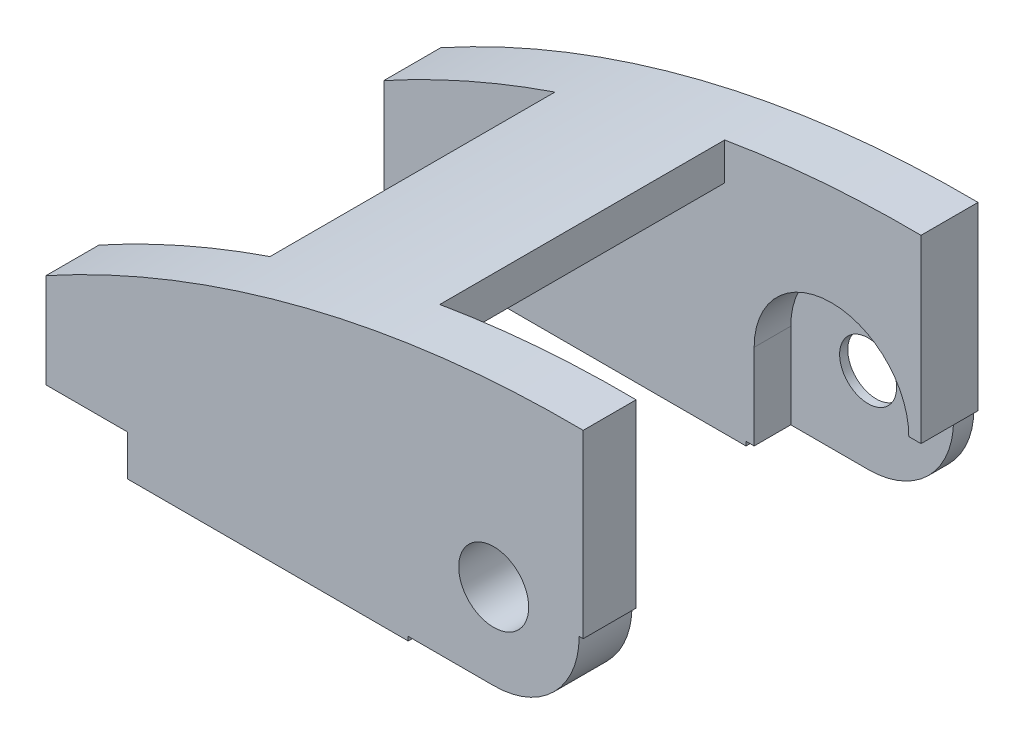
ISO-10303-21;
HEADER;
FILE_DESCRIPTION(('STEP AP214'),'2;1');
FILE_NAME('part.step','',(''),(''),'','','');
FILE_SCHEMA(('AUTOMOTIVE_DESIGN { 1 0 10303 214 1 1 1 1 }'));
ENDSEC;
DATA;
#1=APPLICATION_CONTEXT('core data for automotive mechanical design processes');
#2=APPLICATION_PROTOCOL_DEFINITION('international standard','automotive_design',2000,#1);
#3=PRODUCT_CONTEXT('',#1,'mechanical');
#4=PRODUCT('Part','Part','',(#3));
#5=PRODUCT_RELATED_PRODUCT_CATEGORY('part','',(#4));
#6=PRODUCT_DEFINITION_FORMATION('','',#4);
#7=PRODUCT_DEFINITION_CONTEXT('part definition',#1,'design');
#8=PRODUCT_DEFINITION('design','',#6,#7);
#9=PRODUCT_DEFINITION_SHAPE('','',#8);
#10=(LENGTH_UNIT() NAMED_UNIT(*) SI_UNIT(.MILLI.,.METRE.));
#11=(NAMED_UNIT(*) PLANE_ANGLE_UNIT() SI_UNIT($,.RADIAN.));
#12=(NAMED_UNIT(*) SI_UNIT($,.STERADIAN.) SOLID_ANGLE_UNIT());
#13=UNCERTAINTY_MEASURE_WITH_UNIT(LENGTH_MEASURE(1.E-05),#10,'distance_accuracy_value','');
#14=(GEOMETRIC_REPRESENTATION_CONTEXT(3) GLOBAL_UNCERTAINTY_ASSIGNED_CONTEXT((#13)) GLOBAL_UNIT_ASSIGNED_CONTEXT((#10,
#11,#12)) REPRESENTATION_CONTEXT('',''));
#15=CARTESIAN_POINT('',(0.,0.,0.));
#16=DIRECTION('',(0.,0.,1.));
#17=DIRECTION('',(1.,0.,0.));
#18=AXIS2_PLACEMENT_3D('',#15,#16,#17);
#19=CARTESIAN_POINT('',(0.,0.,0.));
#20=DIRECTION('',(0.,0.,-1.));
#21=DIRECTION('',(1.,0.,0.));
#22=AXIS2_PLACEMENT_3D('',#19,#20,#21);
#23=PLANE('',#22);
#24=DIRECTION('',(0.,-1.,0.));
#25=VECTOR('',#24,1.);
#26=CARTESIAN_POINT('',(-10.5,0.,0.));
#27=LINE('',#26,#25);
#28=CARTESIAN_POINT('',(-10.5,-10.5,0.));
#29=VERTEX_POINT('',#28);
#30=CARTESIAN_POINT('',(-10.5,-11.,0.));
#31=VERTEX_POINT('',#30);
#32=EDGE_CURVE('E344',#29,#31,#27,.T.);
#33=ORIENTED_EDGE('',*,*,#32,.T.);
#34=DIRECTION('',(-1.,0.,0.));
#35=VECTOR('',#34,1.);
#36=CARTESIAN_POINT('',(0.,-11.,0.));
#37=LINE('',#36,#35);
#38=CARTESIAN_POINT('',(-45.,-11.,0.));
#39=VERTEX_POINT('',#38);
#40=EDGE_CURVE('E522',#31,#39,#37,.T.);
#41=ORIENTED_EDGE('',*,*,#40,.T.);
#42=DIRECTION('',(0.,-1.,0.));
#43=VECTOR('',#42,1.);
#44=CARTESIAN_POINT('',(-45.,-11.,0.));
#45=LINE('',#44,#43);
#46=CARTESIAN_POINT('',(-45.,-6.00000000000001,0.));
#47=VERTEX_POINT('',#46);
#48=EDGE_CURVE('E480',#47,#39,#45,.T.);
#49=ORIENTED_EDGE('',*,*,#48,.F.);
#50=DIRECTION('',(1.,0.,0.));
#51=VECTOR('',#50,1.);
#52=CARTESIAN_POINT('',(-55.,-6.,0.));
#53=LINE('',#52,#51);
#54=CARTESIAN_POINT('',(-55.,-6.,0.));
#55=VERTEX_POINT('',#54);
#56=EDGE_CURVE('E476',#55,#47,#53,.T.);
#57=ORIENTED_EDGE('',*,*,#56,.F.);
#58=DIRECTION('',(0.,1.,0.));
#59=VECTOR('',#58,1.);
#60=CARTESIAN_POINT('',(-55.,0.,0.));
#61=LINE('',#60,#59);
#62=CARTESIAN_POINT('',(-55.,5.62869866048854,0.));
#63=VERTEX_POINT('',#62);
#64=EDGE_CURVE('E504',#55,#63,#61,.T.);
#65=ORIENTED_EDGE('',*,*,#64,.T.);
#66=CARTESIAN_POINT('',(9.5633033025968,-112.038627084912,0.));
#67=DIRECTION('',(0.,0.,1.));
#68=DIRECTION('',(1.,0.,0.));
#69=AXIS2_PLACEMENT_3D('',#66,#67,#68);
#70=CIRCLE('',#69,134.216316748067);
#71=CARTESIAN_POINT('',(11.,22.17,0.));
#72=VERTEX_POINT('',#71);
#73=EDGE_CURVE('E471',#72,#63,#70,.T.);
#74=ORIENTED_EDGE('',*,*,#73,.F.);
#75=DIRECTION('',(0.,-1.,0.));
#76=VECTOR('',#75,1.);
#77=CARTESIAN_POINT('',(11.,0.,0.));
#78=LINE('',#77,#76);
#79=CARTESIAN_POINT('',(11.,0.,0.));
#80=VERTEX_POINT('',#79);
#81=EDGE_CURVE('E527',#72,#80,#78,.T.);
#82=ORIENTED_EDGE('',*,*,#81,.T.);
#83=DIRECTION('',(1.,0.,0.));
#84=VECTOR('',#83,1.);
#85=CARTESIAN_POINT('',(0.,0.,0.));
#86=LINE('',#85,#84);
#87=CARTESIAN_POINT('',(10.5,0.,0.));
#88=VERTEX_POINT('',#87);
#89=EDGE_CURVE('E357',#88,#80,#86,.T.);
#90=ORIENTED_EDGE('',*,*,#89,.F.);
#91=CARTESIAN_POINT('',(0.,0.,0.));
#92=DIRECTION('',(0.,0.,1.));
#93=DIRECTION('',(1.,0.,0.));
#94=AXIS2_PLACEMENT_3D('',#91,#92,#93);
#95=CIRCLE('',#94,10.5);
#96=CARTESIAN_POINT('',(1.09981662173559E-13,-10.5,0.));
#97=VERTEX_POINT('',#96);
#98=EDGE_CURVE('E361',#97,#88,#95,.T.);
#99=ORIENTED_EDGE('',*,*,#98,.F.);
#100=DIRECTION('',(-1.,0.,0.));
#101=VECTOR('',#100,1.);
#102=CARTESIAN_POINT('',(0.,-10.5,0.));
#103=LINE('',#102,#101);
#104=EDGE_CURVE('E365',#97,#29,#103,.T.);
#105=ORIENTED_EDGE('',*,*,#104,.T.);
#106=EDGE_LOOP('',(#33,#41,#49,#57,#65,#74,#82,#90,#99,#105));
#107=FACE_BOUND('',#106,.T.);
#108=CARTESIAN_POINT('',(0.,0.,0.));
#109=DIRECTION('',(0.,0.,1.));
#110=DIRECTION('',(1.,0.,0.));
#111=AXIS2_PLACEMENT_3D('',#108,#109,#110);
#112=CIRCLE('',#111,6.);
#113=CARTESIAN_POINT('',(0.,-6.,0.));
#114=VERTEX_POINT('',#113);
#115=CARTESIAN_POINT('',(0.,6.,0.));
#116=VERTEX_POINT('',#115);
#117=EDGE_CURVE('E270',#114,#116,#112,.T.);
#118=ORIENTED_EDGE('',*,*,#117,.T.);
#119=DIRECTION('',(-1.,0.,0.));
#120=VECTOR('',#119,1.);
#121=CARTESIAN_POINT('',(0.,6.,0.));
#122=LINE('',#121,#120);
#123=CARTESIAN_POINT('',(-25.,6.,0.));
#124=VERTEX_POINT('',#123);
#125=EDGE_CURVE('E294',#116,#124,#122,.T.);
#126=ORIENTED_EDGE('',*,*,#125,.T.);
#127=DIRECTION('',(0.,-1.,0.));
#128=VECTOR('',#127,1.);
#129=CARTESIAN_POINT('',(-25.,0.,0.));
#130=LINE('',#129,#128);
#131=CARTESIAN_POINT('',(-25.,-6.,0.));
#132=VERTEX_POINT('',#131);
#133=EDGE_CURVE('E282',#124,#132,#130,.T.);
#134=ORIENTED_EDGE('',*,*,#133,.T.);
#135=DIRECTION('',(-1.,0.,0.));
#136=VECTOR('',#135,1.);
#137=CARTESIAN_POINT('',(0.,-6.,0.));
#138=LINE('',#137,#136);
#139=EDGE_CURVE('E289',#114,#132,#138,.T.);
#140=ORIENTED_EDGE('',*,*,#139,.F.);
#141=EDGE_LOOP('',(#118,#126,#134,#140));
#142=FACE_BOUND('',#141,.T.);
#143=ADVANCED_FACE('F49',(#107,#142),#23,.T.);
#144=CARTESIAN_POINT('',(0.,0.,21.75));
#145=DIRECTION('',(0.,0.,-1.));
#146=DIRECTION('',(1.,0.,0.));
#147=AXIS2_PLACEMENT_3D('',#144,#145,#146);
#148=CYLINDRICAL_SURFACE('',#147,3.5);
#149=CARTESIAN_POINT('',(0.,0.,2.5));
#150=DIRECTION('',(0.,0.,-1.));
#151=DIRECTION('',(0.,1.,0.));
#152=AXIS2_PLACEMENT_3D('',#149,#150,#151);
#153=CIRCLE('',#152,3.5);
#154=CARTESIAN_POINT('',(0.,3.5,2.5));
#155=VERTEX_POINT('',#154);
#156=EDGE_CURVE('E53',#155,#155,#153,.T.);
#157=ORIENTED_EDGE('',*,*,#156,.F.);
#158=EDGE_LOOP('',(#157));
#159=FACE_BOUND('',#158,.T.);
#160=CARTESIAN_POINT('',(0.,0.,1.5));
#161=DIRECTION('',(0.,0.,1.));
#162=DIRECTION('',(1.,0.,0.));
#163=AXIS2_PLACEMENT_3D('',#160,#161,#162);
#164=CIRCLE('',#163,3.5);
#165=CARTESIAN_POINT('',(3.5,0.,1.5));
#166=VERTEX_POINT('',#165);
#167=EDGE_CURVE('E278',#166,#166,#164,.F.);
#168=ORIENTED_EDGE('',*,*,#167,.T.);
#169=EDGE_LOOP('',(#168));
#170=FACE_BOUND('',#169,.T.);
#171=ADVANCED_FACE('F683',(#159,#170),#148,.F.);
#172=CARTESIAN_POINT('',(0.,-10.5,48.5));
#173=DIRECTION('',(0.,1.,0.));
#174=DIRECTION('',(0.,0.,-1.));
#175=AXIS2_PLACEMENT_3D('',#172,#173,#174);
#176=PLANE('',#175);
#177=DIRECTION('',(0.,0.,1.));
#178=VECTOR('',#177,1.);
#179=CARTESIAN_POINT('',(-9.5,-10.5,2.5));
#180=LINE('',#179,#178);
#181=CARTESIAN_POINT('',(-9.5,-10.5,2.5));
#182=VERTEX_POINT('',#181);
#183=CARTESIAN_POINT('',(-9.5,-10.5,7.00000000000001));
#184=VERTEX_POINT('',#183);
#185=EDGE_CURVE('E321',#182,#184,#180,.T.);
#186=ORIENTED_EDGE('',*,*,#185,.T.);
#187=DIRECTION('',(-1.,0.,0.));
#188=VECTOR('',#187,1.);
#189=CARTESIAN_POINT('',(12.,-10.5,7.));
#190=LINE('',#189,#188);
#191=CARTESIAN_POINT('',(-10.5,-10.5,7.00000000000001));
#192=VERTEX_POINT('',#191);
#193=EDGE_CURVE('E402',#184,#192,#190,.T.);
#194=ORIENTED_EDGE('',*,*,#193,.T.);
#195=DIRECTION('',(0.,0.,-1.));
#196=VECTOR('',#195,1.);
#197=CARTESIAN_POINT('',(-10.5,-10.5,48.5));
#198=LINE('',#197,#196);
#199=EDGE_CURVE('E380',#192,#29,#198,.T.);
#200=ORIENTED_EDGE('',*,*,#199,.T.);
#201=ORIENTED_EDGE('',*,*,#104,.F.);
#202=DIRECTION('',(0.,0.,-1.));
#203=VECTOR('',#202,1.);
#204=CARTESIAN_POINT('',(1.09981662173559E-13,-10.5,48.5));
#205=LINE('',#204,#203);
#206=CARTESIAN_POINT('',(1.09981662173559E-13,-10.5,2.50000000000002));
#207=VERTEX_POINT('',#206);
#208=EDGE_CURVE('E384',#207,#97,#205,.T.);
#209=ORIENTED_EDGE('',*,*,#208,.F.);
#210=DIRECTION('',(-1.,0.,0.));
#211=VECTOR('',#210,1.);
#212=CARTESIAN_POINT('',(0.,-10.5,2.5));
#213=LINE('',#212,#211);
#214=EDGE_CURVE('E308',#207,#182,#213,.T.);
#215=ORIENTED_EDGE('',*,*,#214,.T.);
#216=EDGE_LOOP('',(#186,#194,#200,#201,#209,#215));
#217=FACE_BOUND('',#216,.T.);
#218=ADVANCED_FACE('F688',(#217),#176,.F.);
#219=CARTESIAN_POINT('',(11.,0.,48.5));
#220=DIRECTION('',(-1.,0.,0.));
#221=DIRECTION('',(0.,0.,-1.));
#222=AXIS2_PLACEMENT_3D('',#219,#220,#221);
#223=PLANE('',#222);
#224=DIRECTION('',(0.,0.,1.));
#225=VECTOR('',#224,1.);
#226=CARTESIAN_POINT('',(11.,22.17,-1.75000000000001));
#227=LINE('',#226,#225);
#228=CARTESIAN_POINT('',(11.,22.17,42.));
#229=VERTEX_POINT('',#228);
#230=CARTESIAN_POINT('',(11.,22.17,48.5));
#231=VERTEX_POINT('',#230);
#232=EDGE_CURVE('E463',#229,#231,#227,.T.);
#233=ORIENTED_EDGE('',*,*,#232,.T.);
#234=DIRECTION('',(0.,-1.,0.));
#235=VECTOR('',#234,1.);
#236=CARTESIAN_POINT('',(11.,0.,48.5));
#237=LINE('',#236,#235);
#238=CARTESIAN_POINT('',(11.,0.,48.5));
#239=VERTEX_POINT('',#238);
#240=EDGE_CURVE('E531',#231,#239,#237,.T.);
#241=ORIENTED_EDGE('',*,*,#240,.T.);
#242=DIRECTION('',(0.,0.,-1.));
#243=VECTOR('',#242,1.);
#244=CARTESIAN_POINT('',(11.,0.,48.5));
#245=LINE('',#244,#243);
#246=CARTESIAN_POINT('',(11.,0.,42.));
#247=VERTEX_POINT('',#246);
#248=EDGE_CURVE('E539',#239,#247,#245,.T.);
#249=ORIENTED_EDGE('',*,*,#248,.T.);
#250=DIRECTION('',(0.,1.,0.));
#251=VECTOR('',#250,1.);
#252=CARTESIAN_POINT('',(11.,0.,42.));
#253=LINE('',#252,#251);
#254=EDGE_CURVE('E508',#247,#229,#253,.T.);
#255=ORIENTED_EDGE('',*,*,#254,.T.);
#256=EDGE_LOOP('',(#233,#241,#249,#255));
#257=FACE_BOUND('',#256,.T.);
#258=ADVANCED_FACE('F621',(#257),#223,.F.);
#259=CARTESIAN_POINT('',(-55.,0.,0.));
#260=DIRECTION('',(-1.,0.,0.));
#261=DIRECTION('',(0.,-1.,0.));
#262=AXIS2_PLACEMENT_3D('',#259,#260,#261);
#263=PLANE('',#262);
#264=DIRECTION('',(0.,0.,1.));
#265=VECTOR('',#264,1.);
#266=CARTESIAN_POINT('',(-55.,5.62869866048853,-1.75000000000001));
#267=LINE('',#266,#265);
#268=CARTESIAN_POINT('',(-55.,5.62869866048854,7.));
#269=VERTEX_POINT('',#268);
#270=EDGE_CURVE('E565',#63,#269,#267,.T.);
#271=ORIENTED_EDGE('',*,*,#270,.F.);
#272=ORIENTED_EDGE('',*,*,#64,.F.);
#273=DIRECTION('',(0.,0.,1.));
#274=VECTOR('',#273,1.);
#275=CARTESIAN_POINT('',(-55.,-6.,0.));
#276=LINE('',#275,#274);
#277=CARTESIAN_POINT('',(-55.,-6.,7.));
#278=VERTEX_POINT('',#277);
#279=EDGE_CURVE('E556',#55,#278,#276,.T.);
#280=ORIENTED_EDGE('',*,*,#279,.T.);
#281=DIRECTION('',(0.,-1.,0.));
#282=VECTOR('',#281,1.);
#283=CARTESIAN_POINT('',(-55.,0.,7.));
#284=LINE('',#283,#282);
#285=EDGE_CURVE('E444',#269,#278,#284,.T.);
#286=ORIENTED_EDGE('',*,*,#285,.F.);
#287=EDGE_LOOP('',(#271,#272,#280,#286));
#288=FACE_BOUND('',#287,.T.);
#289=ADVANCED_FACE('F679',(#288),#263,.T.);
#290=CARTESIAN_POINT('',(-55.,-6.,0.));
#291=DIRECTION('',(0.,1.,0.));
#292=DIRECTION('',(-1.,0.,0.));
#293=AXIS2_PLACEMENT_3D('',#290,#291,#292);
#294=PLANE('',#293);
#295=DIRECTION('',(-1.,0.,0.));
#296=VECTOR('',#295,1.);
#297=CARTESIAN_POINT('',(-55.,-6.,7.));
#298=LINE('',#297,#296);
#299=CARTESIAN_POINT('',(-45.,-6.00000000000001,7.));
#300=VERTEX_POINT('',#299);
#301=EDGE_CURVE('E441',#300,#278,#298,.T.);
#302=ORIENTED_EDGE('',*,*,#301,.T.);
#303=ORIENTED_EDGE('',*,*,#279,.F.);
#304=ORIENTED_EDGE('',*,*,#56,.T.);
#305=DIRECTION('',(0.,0.,1.));
#306=VECTOR('',#305,1.);
#307=CARTESIAN_POINT('',(-45.,-6.00000000000001,0.));
#308=LINE('',#307,#306);
#309=EDGE_CURVE('E497',#47,#300,#308,.T.);
#310=ORIENTED_EDGE('',*,*,#309,.T.);
#311=EDGE_LOOP('',(#302,#303,#304,#310));
#312=FACE_BOUND('',#311,.T.);
#313=ADVANCED_FACE('F725',(#312),#294,.F.);
#314=CARTESIAN_POINT('',(9.5633033025968,-112.038627084912,-1.75000000000001));
#315=DIRECTION('',(0.,0.,1.));
#316=DIRECTION('',(-1.,0.,0.));
#317=AXIS2_PLACEMENT_3D('',#314,#315,#316);
#318=CYLINDRICAL_SURFACE('',#317,134.216316748067);
#319=DIRECTION('',(0.,0.,1.));
#320=VECTOR('',#319,1.);
#321=CARTESIAN_POINT('',(-33.9746631160101,14.9198903983571,-1.75000000000001));
#322=LINE('',#321,#320);
#323=CARTESIAN_POINT('',(-33.9746631160101,14.9198903983572,42.));
#324=VERTEX_POINT('',#323);
#325=CARTESIAN_POINT('',(-33.9746631160101,14.9198903983572,7.));
#326=VERTEX_POINT('',#325);
#327=EDGE_CURVE('E451',#324,#326,#322,.F.);
#328=ORIENTED_EDGE('',*,*,#327,.F.);
#329=CARTESIAN_POINT('',(9.5633033025968,-112.038627084912,42.));
#330=DIRECTION('',(0.,0.,-1.));
#331=DIRECTION('',(-1.,0.,0.));
#332=AXIS2_PLACEMENT_3D('',#329,#330,#331);
#333=CIRCLE('',#332,134.216316748067);
#334=CARTESIAN_POINT('',(-55.,5.62869866048854,42.));
#335=VERTEX_POINT('',#334);
#336=EDGE_CURVE('E437',#324,#335,#333,.F.);
#337=ORIENTED_EDGE('',*,*,#336,.T.);
#338=CARTESIAN_POINT('',(-55.,5.62869866048853,48.5));
#339=VERTEX_POINT('',#338);
#340=EDGE_CURVE('E564',#335,#339,#267,.T.);
#341=ORIENTED_EDGE('',*,*,#340,.T.);
#342=CARTESIAN_POINT('',(9.5633033025968,-112.038627084912,48.5));
#343=DIRECTION('',(0.,0.,-1.));
#344=DIRECTION('',(-1.,0.,0.));
#345=AXIS2_PLACEMENT_3D('',#342,#343,#344);
#346=CIRCLE('',#345,134.216316748067);
#347=EDGE_CURVE('E468',#339,#231,#346,.T.);
#348=ORIENTED_EDGE('',*,*,#347,.T.);
#349=ORIENTED_EDGE('',*,*,#232,.F.);
#350=CARTESIAN_POINT('',(9.5633033025968,-112.038627084912,42.));
#351=DIRECTION('',(0.,0.,1.));
#352=DIRECTION('',(1.,0.,0.));
#353=AXIS2_PLACEMENT_3D('',#350,#351,#352);
#354=CIRCLE('',#353,134.216316748067);
#355=CARTESIAN_POINT('',(-13.1228451764224,20.2465132317736,42.));
#356=VERTEX_POINT('',#355);
#357=EDGE_CURVE('E414',#356,#229,#354,.F.);
#358=ORIENTED_EDGE('',*,*,#357,.F.);
#359=DIRECTION('',(0.,0.,1.));
#360=VECTOR('',#359,1.);
#361=CARTESIAN_POINT('',(-13.1228451764224,20.2465132317736,-1.75000000000001));
#362=LINE('',#361,#360);
#363=CARTESIAN_POINT('',(-13.1228451764224,20.2465132317736,7.));
#364=VERTEX_POINT('',#363);
#365=EDGE_CURVE('E425',#364,#356,#362,.T.);
#366=ORIENTED_EDGE('',*,*,#365,.F.);
#367=CARTESIAN_POINT('',(9.5633033025968,-112.038627084912,7.));
#368=DIRECTION('',(0.,0.,1.));
#369=DIRECTION('',(1.,0.,0.));
#370=AXIS2_PLACEMENT_3D('',#367,#368,#369);
#371=CIRCLE('',#370,134.216316748067);
#372=CARTESIAN_POINT('',(11.,22.17,7.));
#373=VERTEX_POINT('',#372);
#374=EDGE_CURVE('E421',#364,#373,#371,.F.);
#375=ORIENTED_EDGE('',*,*,#374,.T.);
#376=EDGE_CURVE('E464',#72,#373,#227,.T.);
#377=ORIENTED_EDGE('',*,*,#376,.F.);
#378=ORIENTED_EDGE('',*,*,#73,.T.);
#379=ORIENTED_EDGE('',*,*,#270,.T.);
#380=CARTESIAN_POINT('',(9.5633033025968,-112.038627084912,7.));
#381=DIRECTION('',(0.,0.,-1.));
#382=DIRECTION('',(-1.,0.,0.));
#383=AXIS2_PLACEMENT_3D('',#380,#381,#382);
#384=CIRCLE('',#383,134.216316748067);
#385=EDGE_CURVE('E448',#326,#269,#384,.F.);
#386=ORIENTED_EDGE('',*,*,#385,.F.);
#387=EDGE_LOOP('',(#328,#337,#341,#348,#349,#358,#366,#375,#377,#378,#379,#386));
#388=FACE_BOUND('',#387,.T.);
#389=ADVANCED_FACE('F664',(#388),#318,.T.);
#390=CARTESIAN_POINT('',(-8.45749999999999,-25.4575,44.25));
#391=DIRECTION('',(0.,0.,-1.));
#392=DIRECTION('',(1.,0.,0.));
#393=AXIS2_PLACEMENT_3D('',#390,#391,#392);
#394=CYLINDRICAL_SURFACE('',#393,41.3998624695783);
#395=CARTESIAN_POINT('',(-8.45749999999999,-25.4575,7.));
#396=DIRECTION('',(0.,0.,1.));
#397=DIRECTION('',(0.,-1.,0.));
#398=AXIS2_PLACEMENT_3D('',#395,#396,#397);
#399=CIRCLE('',#398,41.3998624695783);
#400=CARTESIAN_POINT('',(-33.9746631160101,7.14346622817998,7.));
#401=VERTEX_POINT('',#400);
#402=CARTESIAN_POINT('',(-13.1228451764224,15.678654011828,7.));
#403=VERTEX_POINT('',#402);
#404=EDGE_CURVE('E459',#401,#403,#399,.F.);
#405=ORIENTED_EDGE('',*,*,#404,.T.);
#406=DIRECTION('',(0.,0.,-1.));
#407=VECTOR('',#406,1.);
#408=CARTESIAN_POINT('',(-13.1228451764224,15.678654011828,44.25));
#409=LINE('',#408,#407);
#410=CARTESIAN_POINT('',(-13.1228451764224,15.678654011828,42.));
#411=VERTEX_POINT('',#410);
#412=EDGE_CURVE('E569',#411,#403,#409,.T.);
#413=ORIENTED_EDGE('',*,*,#412,.F.);
#414=CARTESIAN_POINT('',(-8.45749999999999,-25.4575,42.));
#415=DIRECTION('',(0.,0.,1.));
#416=DIRECTION('',(1.,0.,0.));
#417=AXIS2_PLACEMENT_3D('',#414,#415,#416);
#418=CIRCLE('',#417,41.3998624695783);
#419=CARTESIAN_POINT('',(-33.9746631160101,7.14346622817998,42.));
#420=VERTEX_POINT('',#419);
#421=EDGE_CURVE('E455',#420,#411,#418,.F.);
#422=ORIENTED_EDGE('',*,*,#421,.F.);
#423=DIRECTION('',(0.,0.,-1.));
#424=VECTOR('',#423,1.);
#425=CARTESIAN_POINT('',(-33.9746631160101,7.14346622817998,44.25));
#426=LINE('',#425,#424);
#427=EDGE_CURVE('E573',#401,#420,#426,.F.);
#428=ORIENTED_EDGE('',*,*,#427,.F.);
#429=EDGE_LOOP('',(#405,#413,#422,#428));
#430=FACE_BOUND('',#429,.T.);
#431=ADVANCED_FACE('F693',(#430),#394,.F.);
#432=CARTESIAN_POINT('',(12.,-12.,7.));
#433=DIRECTION('',(0.,0.,-1.));
#434=DIRECTION('',(0.,-1.,0.));
#435=AXIS2_PLACEMENT_3D('',#432,#433,#434);
#436=PLANE('',#435);
#437=DIRECTION('',(1.,0.,0.));
#438=VECTOR('',#437,1.);
#439=CARTESIAN_POINT('',(12.,0.,7.));
#440=LINE('',#439,#438);
#441=CARTESIAN_POINT('',(9.5,0.,7.));
#442=VERTEX_POINT('',#441);
#443=CARTESIAN_POINT('',(11.,0.,7.00000000000001));
#444=VERTEX_POINT('',#443);
#445=EDGE_CURVE('E390',#442,#444,#440,.T.);
#446=ORIENTED_EDGE('',*,*,#445,.T.);
#447=DIRECTION('',(0.,-1.,0.));
#448=VECTOR('',#447,1.);
#449=CARTESIAN_POINT('',(11.,-12.,7.));
#450=LINE('',#449,#448);
#451=EDGE_CURVE('E543',#373,#444,#450,.T.);
#452=ORIENTED_EDGE('',*,*,#451,.F.);
#453=ORIENTED_EDGE('',*,*,#374,.F.);
#454=DIRECTION('',(0.,-1.,0.));
#455=VECTOR('',#454,1.);
#456=CARTESIAN_POINT('',(-13.1228451764224,24.9751933895616,7.));
#457=LINE('',#456,#455);
#458=EDGE_CURVE('E406',#364,#403,#457,.T.);
#459=ORIENTED_EDGE('',*,*,#458,.T.);
#460=ORIENTED_EDGE('',*,*,#404,.F.);
#461=DIRECTION('',(0.,1.,0.));
#462=VECTOR('',#461,1.);
#463=CARTESIAN_POINT('',(-33.9746631160101,19.6003459082393,7.));
#464=LINE('',#463,#462);
#465=EDGE_CURVE('E410',#401,#326,#464,.T.);
#466=ORIENTED_EDGE('',*,*,#465,.T.);
#467=ORIENTED_EDGE('',*,*,#385,.T.);
#468=ORIENTED_EDGE('',*,*,#285,.T.);
#469=ORIENTED_EDGE('',*,*,#301,.F.);
#470=DIRECTION('',(0.,1.,0.));
#471=VECTOR('',#470,1.);
#472=CARTESIAN_POINT('',(-45.,-12.,7.));
#473=LINE('',#472,#471);
#474=CARTESIAN_POINT('',(-45.,-11.,6.99999999999999));
#475=VERTEX_POINT('',#474);
#476=EDGE_CURVE('E495',#475,#300,#473,.T.);
#477=ORIENTED_EDGE('',*,*,#476,.F.);
#478=DIRECTION('',(-1.,0.,0.));
#479=VECTOR('',#478,1.);
#480=CARTESIAN_POINT('',(0.,-11.,7.));
#481=LINE('',#480,#479);
#482=CARTESIAN_POINT('',(-10.5,-11.,7.00000000000001));
#483=VERTEX_POINT('',#482);
#484=EDGE_CURVE('E523',#483,#475,#481,.T.);
#485=ORIENTED_EDGE('',*,*,#484,.F.);
#486=DIRECTION('',(0.,-1.,0.));
#487=VECTOR('',#486,1.);
#488=CARTESIAN_POINT('',(-10.5,-12.,7.));
#489=LINE('',#488,#487);
#490=EDGE_CURVE('E398',#192,#483,#489,.T.);
#491=ORIENTED_EDGE('',*,*,#490,.F.);
#492=ORIENTED_EDGE('',*,*,#193,.F.);
#493=DIRECTION('',(0.,1.,0.));
#494=VECTOR('',#493,1.);
#495=CARTESIAN_POINT('',(-9.5,-12.,7.));
#496=LINE('',#495,#494);
#497=CARTESIAN_POINT('',(-9.5,0.,7.));
#498=VERTEX_POINT('',#497);
#499=EDGE_CURVE('E331',#184,#498,#496,.T.);
#500=ORIENTED_EDGE('',*,*,#499,.T.);
#501=CARTESIAN_POINT('',(0.,0.,7.));
#502=DIRECTION('',(0.,0.,-1.));
#503=DIRECTION('',(0.,1.,0.));
#504=AXIS2_PLACEMENT_3D('',#501,#502,#503);
#505=CIRCLE('',#504,9.5);
#506=EDGE_CURVE('E548',#498,#442,#505,.T.);
#507=ORIENTED_EDGE('',*,*,#506,.T.);
#508=EDGE_LOOP('',(#446,#452,#453,#459,#460,#466,#467,#468,#469,#477,#485,#491,#492,#500,#507));
#509=FACE_BOUND('',#508,.T.);
#510=ADVANCED_FACE('F597',(#509),#436,.F.);
#511=CARTESIAN_POINT('',(0.,0.,48.5));
#512=DIRECTION('',(0.,0.,1.));
#513=DIRECTION('',(-1.,0.,0.));
#514=AXIS2_PLACEMENT_3D('',#511,#512,#513);
#515=PLANE('',#514);
#516=CARTESIAN_POINT('',(0.,0.,48.5));
#517=DIRECTION('',(0.,0.,1.));
#518=DIRECTION('',(1.,0.,0.));
#519=AXIS2_PLACEMENT_3D('',#516,#517,#518);
#520=CIRCLE('',#519,4.3);
#521=CARTESIAN_POINT('',(4.3,0.,48.5));
#522=VERTEX_POINT('',#521);
#523=EDGE_CURVE('E335',#522,#522,#520,.T.);
#524=ORIENTED_EDGE('',*,*,#523,.F.);
#525=EDGE_LOOP('',(#524));
#526=FACE_BOUND('',#525,.T.);
#527=DIRECTION('',(0.,-1.,0.));
#528=VECTOR('',#527,1.);
#529=CARTESIAN_POINT('',(-10.5,0.,48.5));
#530=LINE('',#529,#528);
#531=CARTESIAN_POINT('',(-10.5,-10.5,48.5));
#532=VERTEX_POINT('',#531);
#533=CARTESIAN_POINT('',(-10.5,-11.,48.5));
#534=VERTEX_POINT('',#533);
#535=EDGE_CURVE('E352',#532,#534,#530,.T.);
#536=ORIENTED_EDGE('',*,*,#535,.F.);
#537=DIRECTION('',(-1.,0.,0.));
#538=VECTOR('',#537,1.);
#539=CARTESIAN_POINT('',(0.,-10.5,48.5));
#540=LINE('',#539,#538);
#541=CARTESIAN_POINT('',(1.09981662173559E-13,-10.5,48.5));
#542=VERTEX_POINT('',#541);
#543=EDGE_CURVE('E348',#542,#532,#540,.T.);
#544=ORIENTED_EDGE('',*,*,#543,.F.);
#545=CARTESIAN_POINT('',(0.,0.,48.5));
#546=DIRECTION('',(0.,0.,1.));
#547=DIRECTION('',(1.,0.,0.));
#548=AXIS2_PLACEMENT_3D('',#545,#546,#547);
#549=CIRCLE('',#548,10.5);
#550=CARTESIAN_POINT('',(10.5,0.,48.5));
#551=VERTEX_POINT('',#550);
#552=EDGE_CURVE('E343',#542,#551,#549,.T.);
#553=ORIENTED_EDGE('',*,*,#552,.T.);
#554=DIRECTION('',(1.,0.,0.));
#555=VECTOR('',#554,1.);
#556=CARTESIAN_POINT('',(0.,0.,48.5));
#557=LINE('',#556,#555);
#558=EDGE_CURVE('E340',#551,#239,#557,.T.);
#559=ORIENTED_EDGE('',*,*,#558,.T.);
#560=ORIENTED_EDGE('',*,*,#240,.F.);
#561=ORIENTED_EDGE('',*,*,#347,.F.);
#562=DIRECTION('',(0.,1.,0.));
#563=VECTOR('',#562,1.);
#564=CARTESIAN_POINT('',(-55.,0.,48.5));
#565=LINE('',#564,#563);
#566=CARTESIAN_POINT('',(-55.,-6.,48.5));
#567=VERTEX_POINT('',#566);
#568=EDGE_CURVE('E503',#567,#339,#565,.T.);
#569=ORIENTED_EDGE('',*,*,#568,.F.);
#570=DIRECTION('',(1.,0.,0.));
#571=VECTOR('',#570,1.);
#572=CARTESIAN_POINT('',(-55.,-6.,48.5));
#573=LINE('',#572,#571);
#574=CARTESIAN_POINT('',(-45.,-6.00000000000001,48.5));
#575=VERTEX_POINT('',#574);
#576=EDGE_CURVE('E475',#567,#575,#573,.T.);
#577=ORIENTED_EDGE('',*,*,#576,.T.);
#578=DIRECTION('',(0.,-1.,0.));
#579=VECTOR('',#578,1.);
#580=CARTESIAN_POINT('',(-45.,-11.,48.5));
#581=LINE('',#580,#579);
#582=CARTESIAN_POINT('',(-45.,-11.,48.5));
#583=VERTEX_POINT('',#582);
#584=EDGE_CURVE('E481',#575,#583,#581,.T.);
#585=ORIENTED_EDGE('',*,*,#584,.T.);
#586=DIRECTION('',(-1.,0.,0.));
#587=VECTOR('',#586,1.);
#588=CARTESIAN_POINT('',(0.,-11.,48.5));
#589=LINE('',#588,#587);
#590=EDGE_CURVE('E518',#534,#583,#589,.T.);
#591=ORIENTED_EDGE('',*,*,#590,.F.);
#592=EDGE_LOOP('',(#536,#544,#553,#559,#560,#561,#569,#577,#585,#591));
#593=FACE_BOUND('',#592,.T.);
#594=ADVANCED_FACE('F594',(#526,#593),#515,.T.);
#595=CARTESIAN_POINT('',(0.,0.,42.));
#596=DIRECTION('',(0.,0.,-1.));
#597=DIRECTION('',(1.,0.,0.));
#598=AXIS2_PLACEMENT_3D('',#595,#596,#597);
#599=PLANE('',#598);
#600=CARTESIAN_POINT('',(0.,0.,42.));
#601=DIRECTION('',(0.,0.,1.));
#602=DIRECTION('',(1.,0.,0.));
#603=AXIS2_PLACEMENT_3D('',#600,#601,#602);
#604=CIRCLE('',#603,4.3);
#605=CARTESIAN_POINT('',(4.3,0.,42.));
#606=VERTEX_POINT('',#605);
#607=EDGE_CURVE('E339',#606,#606,#604,.T.);
#608=ORIENTED_EDGE('',*,*,#607,.T.);
#609=EDGE_LOOP('',(#608));
#610=FACE_BOUND('',#609,.T.);
#611=DIRECTION('',(0.,-1.,0.));
#612=VECTOR('',#611,1.);
#613=CARTESIAN_POINT('',(-10.5,0.,42.));
#614=LINE('',#613,#612);
#615=CARTESIAN_POINT('',(-10.5,-10.5,42.));
#616=VERTEX_POINT('',#615);
#617=CARTESIAN_POINT('',(-10.5,-11.,42.));
#618=VERTEX_POINT('',#617);
#619=EDGE_CURVE('E394',#616,#618,#614,.T.);
#620=ORIENTED_EDGE('',*,*,#619,.T.);
#621=DIRECTION('',(1.,0.,0.));
#622=VECTOR('',#621,1.);
#623=CARTESIAN_POINT('',(0.,-11.,42.));
#624=LINE('',#623,#622);
#625=CARTESIAN_POINT('',(-45.,-11.,42.));
#626=VERTEX_POINT('',#625);
#627=EDGE_CURVE('E514',#626,#618,#624,.T.);
#628=ORIENTED_EDGE('',*,*,#627,.F.);
#629=DIRECTION('',(0.,1.,0.));
#630=VECTOR('',#629,1.);
#631=CARTESIAN_POINT('',(-45.,0.,42.));
#632=LINE('',#631,#630);
#633=CARTESIAN_POINT('',(-45.,-6.00000000000001,42.));
#634=VERTEX_POINT('',#633);
#635=EDGE_CURVE('E560',#626,#634,#632,.T.);
#636=ORIENTED_EDGE('',*,*,#635,.T.);
#637=DIRECTION('',(-1.,0.,0.));
#638=VECTOR('',#637,1.);
#639=CARTESIAN_POINT('',(-55.,-6.,42.));
#640=LINE('',#639,#638);
#641=CARTESIAN_POINT('',(-55.,-6.,42.));
#642=VERTEX_POINT('',#641);
#643=EDGE_CURVE('E429',#634,#642,#640,.T.);
#644=ORIENTED_EDGE('',*,*,#643,.T.);
#645=DIRECTION('',(0.,-1.,0.));
#646=VECTOR('',#645,1.);
#647=CARTESIAN_POINT('',(-55.,0.,42.));
#648=LINE('',#647,#646);
#649=EDGE_CURVE('E433',#335,#642,#648,.T.);
#650=ORIENTED_EDGE('',*,*,#649,.F.);
#651=ORIENTED_EDGE('',*,*,#336,.F.);
#652=DIRECTION('',(0.,1.,0.));
#653=VECTOR('',#652,1.);
#654=CARTESIAN_POINT('',(-33.9746631160101,19.6003459082393,42.));
#655=LINE('',#654,#653);
#656=EDGE_CURVE('E407',#420,#324,#655,.T.);
#657=ORIENTED_EDGE('',*,*,#656,.F.);
#658=ORIENTED_EDGE('',*,*,#421,.T.);
#659=DIRECTION('',(0.,-1.,0.));
#660=VECTOR('',#659,1.);
#661=CARTESIAN_POINT('',(-13.1228451764224,24.9751933895616,42.));
#662=LINE('',#661,#660);
#663=EDGE_CURVE('E411',#356,#411,#662,.T.);
#664=ORIENTED_EDGE('',*,*,#663,.F.);
#665=ORIENTED_EDGE('',*,*,#357,.T.);
#666=ORIENTED_EDGE('',*,*,#254,.F.);
#667=DIRECTION('',(1.,0.,0.));
#668=VECTOR('',#667,1.);
#669=CARTESIAN_POINT('',(0.,0.,42.));
#670=LINE('',#669,#668);
#671=CARTESIAN_POINT('',(10.5,0.,42.));
#672=VERTEX_POINT('',#671);
#673=EDGE_CURVE('E375',#672,#247,#670,.T.);
#674=ORIENTED_EDGE('',*,*,#673,.F.);
#675=CARTESIAN_POINT('',(0.,0.,42.));
#676=DIRECTION('',(0.,0.,1.));
#677=DIRECTION('',(1.,0.,0.));
#678=AXIS2_PLACEMENT_3D('',#675,#676,#677);
#679=CIRCLE('',#678,10.5);
#680=CARTESIAN_POINT('',(1.09981662173559E-13,-10.5,42.));
#681=VERTEX_POINT('',#680);
#682=EDGE_CURVE('E59',#681,#672,#679,.T.);
#683=ORIENTED_EDGE('',*,*,#682,.F.);
#684=DIRECTION('',(-1.,0.,0.));
#685=VECTOR('',#684,1.);
#686=CARTESIAN_POINT('',(0.,-10.5,42.));
#687=LINE('',#686,#685);
#688=EDGE_CURVE('E11',#681,#616,#687,.T.);
#689=ORIENTED_EDGE('',*,*,#688,.T.);
#690=EDGE_LOOP('',(#620,#628,#636,#644,#650,#651,#657,#658,#664,#665,#666,#674,#683,#689));
#691=FACE_BOUND('',#690,.T.);
#692=ADVANCED_FACE('F583',(#610,#691),#599,.T.);
#693=ORIENTED_EDGE('',*,*,#451,.T.);
#694=EDGE_CURVE('E535',#444,#80,#245,.T.);
#695=ORIENTED_EDGE('',*,*,#694,.T.);
#696=ORIENTED_EDGE('',*,*,#81,.F.);
#697=ORIENTED_EDGE('',*,*,#376,.T.);
#698=EDGE_LOOP('',(#693,#695,#696,#697));
#699=FACE_BOUND('',#698,.T.);
#700=ADVANCED_FACE('F644',(#699),#223,.F.);
#701=ORIENTED_EDGE('',*,*,#649,.T.);
#702=EDGE_CURVE('E552',#642,#567,#276,.T.);
#703=ORIENTED_EDGE('',*,*,#702,.T.);
#704=ORIENTED_EDGE('',*,*,#568,.T.);
#705=ORIENTED_EDGE('',*,*,#340,.F.);
#706=EDGE_LOOP('',(#701,#703,#704,#705));
#707=FACE_BOUND('',#706,.T.);
#708=ADVANCED_FACE('F660',(#707),#263,.T.);
#709=CARTESIAN_POINT('',(0.,-11.,7.));
#710=DIRECTION('',(0.,1.,0.));
#711=DIRECTION('',(-1.,0.,0.));
#712=AXIS2_PLACEMENT_3D('',#709,#710,#711);
#713=PLANE('',#712);
#714=ORIENTED_EDGE('',*,*,#590,.T.);
#715=DIRECTION('',(0.,0.,1.));
#716=VECTOR('',#715,1.);
#717=CARTESIAN_POINT('',(-45.,-11.,0.));
#718=LINE('',#717,#716);
#719=EDGE_CURVE('E496',#626,#583,#718,.T.);
#720=ORIENTED_EDGE('',*,*,#719,.F.);
#721=ORIENTED_EDGE('',*,*,#627,.T.);
#722=DIRECTION('',(0.,0.,-1.));
#723=VECTOR('',#722,1.);
#724=CARTESIAN_POINT('',(-10.5,-11.,48.5));
#725=LINE('',#724,#723);
#726=EDGE_CURVE('E372',#534,#618,#725,.T.);
#727=ORIENTED_EDGE('',*,*,#726,.F.);
#728=EDGE_LOOP('',(#714,#720,#721,#727));
#729=FACE_BOUND('',#728,.T.);
#730=ADVANCED_FACE('F669',(#729),#713,.F.);
#731=ORIENTED_EDGE('',*,*,#484,.T.);
#732=EDGE_CURVE('E492',#39,#475,#718,.T.);
#733=ORIENTED_EDGE('',*,*,#732,.F.);
#734=ORIENTED_EDGE('',*,*,#40,.F.);
#735=EDGE_CURVE('E376',#483,#31,#725,.T.);
#736=ORIENTED_EDGE('',*,*,#735,.F.);
#737=EDGE_LOOP('',(#731,#733,#734,#736));
#738=FACE_BOUND('',#737,.T.);
#739=ADVANCED_FACE('F671',(#738),#713,.F.);
#740=CARTESIAN_POINT('',(0.,0.,2.5));
#741=DIRECTION('',(0.,0.,1.));
#742=DIRECTION('',(0.,1.,0.));
#743=AXIS2_PLACEMENT_3D('',#740,#741,#742);
#744=PLANE('',#743);
#745=ORIENTED_EDGE('',*,*,#156,.T.);
#746=EDGE_LOOP('',(#745));
#747=FACE_BOUND('',#746,.T.);
#748=CARTESIAN_POINT('',(0.,0.,2.5));
#749=DIRECTION('',(0.,0.,-1.));
#750=DIRECTION('',(0.,1.,0.));
#751=AXIS2_PLACEMENT_3D('',#748,#749,#750);
#752=CIRCLE('',#751,9.5);
#753=CARTESIAN_POINT('',(-9.5,0.,2.5));
#754=VERTEX_POINT('',#753);
#755=CARTESIAN_POINT('',(9.5,0.,2.5));
#756=VERTEX_POINT('',#755);
#757=EDGE_CURVE('E547',#754,#756,#752,.T.);
#758=ORIENTED_EDGE('',*,*,#757,.F.);
#759=DIRECTION('',(0.,-1.,0.));
#760=VECTOR('',#759,1.);
#761=CARTESIAN_POINT('',(-9.5,0.,2.5));
#762=LINE('',#761,#760);
#763=EDGE_CURVE('E318',#754,#182,#762,.T.);
#764=ORIENTED_EDGE('',*,*,#763,.T.);
#765=ORIENTED_EDGE('',*,*,#214,.F.);
#766=CARTESIAN_POINT('',(0.,0.,2.5));
#767=DIRECTION('',(0.,0.,1.));
#768=DIRECTION('',(1.,0.,0.));
#769=AXIS2_PLACEMENT_3D('',#766,#767,#768);
#770=CIRCLE('',#769,10.5);
#771=CARTESIAN_POINT('',(10.5,0.,2.5));
#772=VERTEX_POINT('',#771);
#773=EDGE_CURVE('E75',#207,#772,#770,.T.);
#774=ORIENTED_EDGE('',*,*,#773,.T.);
#775=DIRECTION('',(1.,0.,0.));
#776=VECTOR('',#775,1.);
#777=CARTESIAN_POINT('',(0.,0.,2.5));
#778=LINE('',#777,#776);
#779=EDGE_CURVE('E314',#756,#772,#778,.T.);
#780=ORIENTED_EDGE('',*,*,#779,.F.);
#781=EDGE_LOOP('',(#758,#764,#765,#774,#780));
#782=FACE_BOUND('',#781,.T.);
#783=ADVANCED_FACE('F51',(#747,#782),#744,.T.);
#784=CARTESIAN_POINT('',(0.,0.,2.5));
#785=DIRECTION('',(0.,0.,1.));
#786=DIRECTION('',(0.,1.,0.));
#787=AXIS2_PLACEMENT_3D('',#784,#785,#786);
#788=CYLINDRICAL_SURFACE('',#787,9.5);
#789=ORIENTED_EDGE('',*,*,#506,.F.);
#790=DIRECTION('',(0.,0.,1.));
#791=VECTOR('',#790,1.);
#792=CARTESIAN_POINT('',(-9.5,0.,2.5));
#793=LINE('',#792,#791);
#794=EDGE_CURVE('E325',#754,#498,#793,.T.);
#795=ORIENTED_EDGE('',*,*,#794,.F.);
#796=ORIENTED_EDGE('',*,*,#757,.T.);
#797=DIRECTION('',(0.,0.,1.));
#798=VECTOR('',#797,1.);
#799=CARTESIAN_POINT('',(9.5,0.,2.5));
#800=LINE('',#799,#798);
#801=EDGE_CURVE('E328',#756,#442,#800,.T.);
#802=ORIENTED_EDGE('',*,*,#801,.T.);
#803=EDGE_LOOP('',(#789,#795,#796,#802));
#804=FACE_BOUND('',#803,.T.);
#805=ADVANCED_FACE('F695',(#804),#788,.F.);
#806=CARTESIAN_POINT('',(-45.,-11.,0.));
#807=DIRECTION('',(1.,0.,0.));
#808=DIRECTION('',(0.,0.,1.));
#809=AXIS2_PLACEMENT_3D('',#806,#807,#808);
#810=PLANE('',#809);
#811=ORIENTED_EDGE('',*,*,#635,.F.);
#812=ORIENTED_EDGE('',*,*,#719,.T.);
#813=ORIENTED_EDGE('',*,*,#584,.F.);
#814=EDGE_CURVE('E485',#634,#575,#308,.T.);
#815=ORIENTED_EDGE('',*,*,#814,.F.);
#816=EDGE_LOOP('',(#811,#812,#813,#815));
#817=FACE_BOUND('',#816,.T.);
#818=ADVANCED_FACE('F656',(#817),#810,.F.);
#819=ORIENTED_EDGE('',*,*,#732,.T.);
#820=ORIENTED_EDGE('',*,*,#476,.T.);
#821=ORIENTED_EDGE('',*,*,#309,.F.);
#822=ORIENTED_EDGE('',*,*,#48,.T.);
#823=EDGE_LOOP('',(#819,#820,#821,#822));
#824=FACE_BOUND('',#823,.T.);
#825=ADVANCED_FACE('F702',(#824),#810,.F.);
#826=ORIENTED_EDGE('',*,*,#814,.T.);
#827=ORIENTED_EDGE('',*,*,#576,.F.);
#828=ORIENTED_EDGE('',*,*,#702,.F.);
#829=ORIENTED_EDGE('',*,*,#643,.F.);
#830=EDGE_LOOP('',(#826,#827,#828,#829));
#831=FACE_BOUND('',#830,.T.);
#832=ADVANCED_FACE('F652',(#831),#294,.F.);
#833=CARTESIAN_POINT('',(-13.1228451764224,24.9751933895616,7.));
#834=DIRECTION('',(1.,0.,0.));
#835=DIRECTION('',(0.,0.,1.));
#836=AXIS2_PLACEMENT_3D('',#833,#834,#835);
#837=PLANE('',#836);
#838=ORIENTED_EDGE('',*,*,#458,.F.);
#839=ORIENTED_EDGE('',*,*,#365,.T.);
#840=ORIENTED_EDGE('',*,*,#663,.T.);
#841=ORIENTED_EDGE('',*,*,#412,.T.);
#842=EDGE_LOOP('',(#838,#839,#840,#841));
#843=FACE_BOUND('',#842,.T.);
#844=ADVANCED_FACE('F734',(#843),#837,.T.);
#845=CARTESIAN_POINT('',(-33.9746631160101,19.6003459082393,7.));
#846=DIRECTION('',(-1.,0.,0.));
#847=DIRECTION('',(0.,0.,-1.));
#848=AXIS2_PLACEMENT_3D('',#845,#846,#847);
#849=PLANE('',#848);
#850=ORIENTED_EDGE('',*,*,#656,.T.);
#851=ORIENTED_EDGE('',*,*,#327,.T.);
#852=ORIENTED_EDGE('',*,*,#465,.F.);
#853=ORIENTED_EDGE('',*,*,#427,.T.);
#854=EDGE_LOOP('',(#850,#851,#852,#853));
#855=FACE_BOUND('',#854,.T.);
#856=ADVANCED_FACE('F739',(#855),#849,.T.);
#857=CARTESIAN_POINT('',(-10.5,0.,48.5));
#858=DIRECTION('',(-1.,0.,0.));
#859=DIRECTION('',(0.,0.,-1.));
#860=AXIS2_PLACEMENT_3D('',#857,#858,#859);
#861=PLANE('',#860);
#862=ORIENTED_EDGE('',*,*,#199,.F.);
#863=ORIENTED_EDGE('',*,*,#490,.T.);
#864=ORIENTED_EDGE('',*,*,#735,.T.);
#865=ORIENTED_EDGE('',*,*,#32,.F.);
#866=EDGE_LOOP('',(#862,#863,#864,#865));
#867=FACE_BOUND('',#866,.T.);
#868=ADVANCED_FACE('F716',(#867),#861,.F.);
#869=CARTESIAN_POINT('',(0.,0.,48.5));
#870=DIRECTION('',(0.,-1.,0.));
#871=DIRECTION('',(0.,0.,1.));
#872=AXIS2_PLACEMENT_3D('',#869,#870,#871);
#873=PLANE('',#872);
#874=ORIENTED_EDGE('',*,*,#445,.F.);
#875=ORIENTED_EDGE('',*,*,#801,.F.);
#876=ORIENTED_EDGE('',*,*,#779,.T.);
#877=DIRECTION('',(0.,0.,-1.));
#878=VECTOR('',#877,1.);
#879=CARTESIAN_POINT('',(10.5,0.,48.5));
#880=LINE('',#879,#878);
#881=EDGE_CURVE('E356',#772,#88,#880,.T.);
#882=ORIENTED_EDGE('',*,*,#881,.T.);
#883=ORIENTED_EDGE('',*,*,#89,.T.);
#884=ORIENTED_EDGE('',*,*,#694,.F.);
#885=EDGE_LOOP('',(#874,#875,#876,#882,#883,#884));
#886=FACE_BOUND('',#885,.T.);
#887=ADVANCED_FACE('F632',(#886),#873,.T.);
#888=CARTESIAN_POINT('',(0.,0.,48.5));
#889=DIRECTION('',(0.,0.,-1.));
#890=DIRECTION('',(1.,0.,0.));
#891=AXIS2_PLACEMENT_3D('',#888,#889,#890);
#892=CYLINDRICAL_SURFACE('',#891,10.5);
#893=ORIENTED_EDGE('',*,*,#773,.F.);
#894=ORIENTED_EDGE('',*,*,#208,.T.);
#895=ORIENTED_EDGE('',*,*,#98,.T.);
#896=ORIENTED_EDGE('',*,*,#881,.F.);
#897=EDGE_LOOP('',(#893,#894,#895,#896));
#898=FACE_BOUND('',#897,.T.);
#899=ADVANCED_FACE('F636',(#898),#892,.T.);
#900=ORIENTED_EDGE('',*,*,#619,.F.);
#901=EDGE_CURVE('E377',#532,#616,#198,.T.);
#902=ORIENTED_EDGE('',*,*,#901,.F.);
#903=ORIENTED_EDGE('',*,*,#535,.T.);
#904=ORIENTED_EDGE('',*,*,#726,.T.);
#905=EDGE_LOOP('',(#900,#902,#903,#904));
#906=FACE_BOUND('',#905,.T.);
#907=ADVANCED_FACE('F604',(#906),#861,.F.);
#908=ORIENTED_EDGE('',*,*,#688,.F.);
#909=EDGE_CURVE('E381',#542,#681,#205,.T.);
#910=ORIENTED_EDGE('',*,*,#909,.F.);
#911=ORIENTED_EDGE('',*,*,#543,.T.);
#912=ORIENTED_EDGE('',*,*,#901,.T.);
#913=EDGE_LOOP('',(#908,#910,#911,#912));
#914=FACE_BOUND('',#913,.T.);
#915=ADVANCED_FACE('F607',(#914),#176,.F.);
#916=ORIENTED_EDGE('',*,*,#909,.T.);
#917=ORIENTED_EDGE('',*,*,#682,.T.);
#918=EDGE_CURVE('E385',#551,#672,#880,.T.);
#919=ORIENTED_EDGE('',*,*,#918,.F.);
#920=ORIENTED_EDGE('',*,*,#552,.F.);
#921=EDGE_LOOP('',(#916,#917,#919,#920));
#922=FACE_BOUND('',#921,.T.);
#923=ADVANCED_FACE('F611',(#922),#892,.T.);
#924=ORIENTED_EDGE('',*,*,#918,.T.);
#925=ORIENTED_EDGE('',*,*,#673,.T.);
#926=ORIENTED_EDGE('',*,*,#248,.F.);
#927=ORIENTED_EDGE('',*,*,#558,.F.);
#928=EDGE_LOOP('',(#924,#925,#926,#927));
#929=FACE_BOUND('',#928,.T.);
#930=ADVANCED_FACE('F590',(#929),#873,.T.);
#931=CARTESIAN_POINT('',(0.,0.,48.5));
#932=DIRECTION('',(0.,0.,-1.));
#933=DIRECTION('',(1.,0.,0.));
#934=AXIS2_PLACEMENT_3D('',#931,#932,#933);
#935=CYLINDRICAL_SURFACE('',#934,4.3);
#936=CARTESIAN_POINT('',(4.3,0.,42.));
#937=CARTESIAN_POINT('',(4.3,0.,42.0677083333333));
#938=CARTESIAN_POINT('',(4.3,0.,42.1354166666667));
#939=CARTESIAN_POINT('',(4.3,0.,42.2708333333333));
#940=CARTESIAN_POINT('',(4.3,0.,42.3385416666667));
#941=CARTESIAN_POINT('',(4.3,0.,42.4739583333333));
#942=CARTESIAN_POINT('',(4.3,0.,42.5416666666667));
#943=CARTESIAN_POINT('',(4.3,0.,42.6770833333333));
#944=CARTESIAN_POINT('',(4.3,0.,42.7447916666667));
#945=CARTESIAN_POINT('',(4.3,0.,42.8802083333333));
#946=CARTESIAN_POINT('',(4.3,0.,42.9479166666667));
#947=CARTESIAN_POINT('',(4.3,0.,43.0833333333333));
#948=CARTESIAN_POINT('',(4.3,0.,43.1510416666667));
#949=CARTESIAN_POINT('',(4.3,0.,43.2864583333333));
#950=CARTESIAN_POINT('',(4.3,0.,43.3541666666667));
#951=CARTESIAN_POINT('',(4.3,0.,43.4895833333333));
#952=CARTESIAN_POINT('',(4.3,0.,43.5572916666667));
#953=CARTESIAN_POINT('',(4.3,0.,43.6927083333333));
#954=CARTESIAN_POINT('',(4.3,0.,43.7604166666667));
#955=CARTESIAN_POINT('',(4.3,0.,43.8958333333333));
#956=CARTESIAN_POINT('',(4.3,0.,43.9635416666667));
#957=CARTESIAN_POINT('',(4.3,0.,44.0989583333333));
#958=CARTESIAN_POINT('',(4.3,0.,44.1666666666667));
#959=CARTESIAN_POINT('',(4.3,0.,44.3020833333333));
#960=CARTESIAN_POINT('',(4.3,0.,44.3697916666667));
#961=CARTESIAN_POINT('',(4.3,0.,44.5052083333333));
#962=CARTESIAN_POINT('',(4.3,0.,44.5729166666667));
#963=CARTESIAN_POINT('',(4.3,0.,44.7083333333333));
#964=CARTESIAN_POINT('',(4.3,0.,44.7760416666667));
#965=CARTESIAN_POINT('',(4.3,0.,44.9114583333333));
#966=CARTESIAN_POINT('',(4.3,0.,44.9791666666667));
#967=CARTESIAN_POINT('',(4.3,0.,45.1145833333333));
#968=CARTESIAN_POINT('',(4.3,0.,45.1822916666667));
#969=CARTESIAN_POINT('',(4.3,0.,45.3177083333333));
#970=CARTESIAN_POINT('',(4.3,0.,45.3854166666667));
#971=CARTESIAN_POINT('',(4.3,0.,45.5208333333333));
#972=CARTESIAN_POINT('',(4.3,0.,45.5885416666667));
#973=CARTESIAN_POINT('',(4.3,0.,45.7239583333333));
#974=CARTESIAN_POINT('',(4.3,0.,45.7916666666667));
#975=CARTESIAN_POINT('',(4.3,0.,45.9270833333333));
#976=CARTESIAN_POINT('',(4.3,0.,45.9947916666667));
#977=CARTESIAN_POINT('',(4.3,0.,46.1302083333333));
#978=CARTESIAN_POINT('',(4.3,0.,46.1979166666667));
#979=CARTESIAN_POINT('',(4.3,0.,46.3333333333333));
#980=CARTESIAN_POINT('',(4.3,0.,46.4010416666667));
#981=CARTESIAN_POINT('',(4.3,0.,46.5364583333333));
#982=CARTESIAN_POINT('',(4.3,0.,46.6041666666667));
#983=CARTESIAN_POINT('',(4.3,0.,46.7395833333333));
#984=CARTESIAN_POINT('',(4.3,0.,46.8072916666667));
#985=CARTESIAN_POINT('',(4.3,0.,46.9427083333333));
#986=CARTESIAN_POINT('',(4.3,0.,47.0104166666667));
#987=CARTESIAN_POINT('',(4.3,0.,47.1458333333333));
#988=CARTESIAN_POINT('',(4.3,0.,47.2135416666667));
#989=CARTESIAN_POINT('',(4.3,0.,47.3489583333333));
#990=CARTESIAN_POINT('',(4.3,0.,47.4166666666667));
#991=CARTESIAN_POINT('',(4.3,0.,47.5520833333333));
#992=CARTESIAN_POINT('',(4.3,0.,47.6197916666667));
#993=CARTESIAN_POINT('',(4.3,0.,47.7552083333333));
#994=CARTESIAN_POINT('',(4.3,0.,47.8229166666667));
#995=CARTESIAN_POINT('',(4.3,0.,47.9583333333333));
#996=CARTESIAN_POINT('',(4.3,0.,48.0260416666667));
#997=CARTESIAN_POINT('',(4.3,0.,48.1614583333333));
#998=CARTESIAN_POINT('',(4.3,0.,48.2291666666667));
#999=CARTESIAN_POINT('',(4.3,0.,48.3645833333333));
#1000=CARTESIAN_POINT('',(4.3,0.,48.4322916666667));
#1001=CARTESIAN_POINT('',(4.3,0.,48.5));
#1002=B_SPLINE_CURVE_WITH_KNOTS('',3,(#936,#937,#938,#939,#940,#941,#942,#943,#944,#945,#946,
#947,#948,#949,#950,#951,#952,#953,#954,#955,#956,#957,#958,#959,#960,#961,#962,#963,#964,#965,
#966,#967,#968,#969,#970,#971,#972,#973,#974,#975,#976,#977,#978,#979,#980,#981,#982,#983,#984,
#985,#986,#987,#988,#989,#990,#991,#992,#993,#994,#995,#996,#997,#998,#999,#1000,#1001),
.UNSPECIFIED.,.F.,.F.,(4,2,2,2,2,2,2,2,2,2,2,2,2,2,2,2,2,2,2,2,2,2,2,2,2,2,2,2,2,2,2,2,4),(0.,
0.203124999999998,0.406249999999997,0.609374999999995,0.812500000000001,1.015625,1.21875,
1.421875,1.62499999999999,1.828125,2.03125,2.234375,2.4375,2.64062499999999,2.84375,3.046875,
3.25,3.45312499999999,3.65624999999999,3.859375,4.0625,4.26562499999999,4.46874999999999,
4.671875,4.875,5.078125,5.28124999999999,5.48437499999999,5.6875,5.890625,6.09374999999999,
6.29687499999999,6.5),.UNSPECIFIED.);
#1003=EDGE_CURVE('BSEAM586',#606,#522,#1002,.T.);
#1004=ORIENTED_EDGE('',*,*,#607,.F.);
#1005=ORIENTED_EDGE('',*,*,#523,.T.);
#1006=ORIENTED_EDGE('',*,*,#1003,.T.);
#1007=ORIENTED_EDGE('',*,*,#1003,.F.);
#1008=EDGE_LOOP('',(#1004,#1006,#1005,#1007));
#1009=FACE_BOUND('',#1008,.T.);
#1010=ADVANCED_FACE('F586',(#1009),#935,.F.);
#1011=CARTESIAN_POINT('',(-9.5,0.,2.5));
#1012=DIRECTION('',(1.,0.,0.));
#1013=DIRECTION('',(0.,0.,1.));
#1014=AXIS2_PLACEMENT_3D('',#1011,#1012,#1013);
#1015=PLANE('',#1014);
#1016=ORIENTED_EDGE('',*,*,#499,.F.);
#1017=ORIENTED_EDGE('',*,*,#185,.F.);
#1018=ORIENTED_EDGE('',*,*,#763,.F.);
#1019=ORIENTED_EDGE('',*,*,#794,.T.);
#1020=EDGE_LOOP('',(#1016,#1017,#1018,#1019));
#1021=FACE_BOUND('',#1020,.T.);
#1022=ADVANCED_FACE('F589',(#1021),#1015,.T.);
#1023=CARTESIAN_POINT('',(0.,-6.,1.5));
#1024=DIRECTION('',(0.,1.,0.));
#1025=DIRECTION('',(-1.,0.,0.));
#1026=AXIS2_PLACEMENT_3D('',#1023,#1024,#1025);
#1027=PLANE('',#1026);
#1028=ORIENTED_EDGE('',*,*,#139,.T.);
#1029=DIRECTION('',(0.,0.,-1.));
#1030=VECTOR('',#1029,1.);
#1031=CARTESIAN_POINT('',(-25.,-6.,1.5));
#1032=LINE('',#1031,#1030);
#1033=CARTESIAN_POINT('',(-25.,-6.,1.5));
#1034=VERTEX_POINT('',#1033);
#1035=EDGE_CURVE('E276',#1034,#132,#1032,.T.);
#1036=ORIENTED_EDGE('',*,*,#1035,.F.);
#1037=DIRECTION('',(-1.,0.,0.));
#1038=VECTOR('',#1037,1.);
#1039=CARTESIAN_POINT('',(0.,-6.,1.5));
#1040=LINE('',#1039,#1038);
#1041=CARTESIAN_POINT('',(0.,-6.,1.5));
#1042=VERTEX_POINT('',#1041);
#1043=EDGE_CURVE('E260',#1042,#1034,#1040,.T.);
#1044=ORIENTED_EDGE('',*,*,#1043,.F.);
#1045=DIRECTION('',(0.,0.,-1.));
#1046=VECTOR('',#1045,1.);
#1047=CARTESIAN_POINT('',(0.,-6.,1.5));
#1048=LINE('',#1047,#1046);
#1049=EDGE_CURVE('E67',#1042,#114,#1048,.T.);
#1050=ORIENTED_EDGE('',*,*,#1049,.T.);
#1051=EDGE_LOOP('',(#1028,#1036,#1044,#1050));
#1052=FACE_BOUND('',#1051,.T.);
#1053=ADVANCED_FACE('F275',(#1052),#1027,.T.);
#1054=CARTESIAN_POINT('',(-25.,0.,1.5));
#1055=DIRECTION('',(-1.,0.,0.));
#1056=DIRECTION('',(0.,0.,-1.));
#1057=AXIS2_PLACEMENT_3D('',#1054,#1055,#1056);
#1058=PLANE('',#1057);
#1059=ORIENTED_EDGE('',*,*,#133,.F.);
#1060=DIRECTION('',(0.,0.,-1.));
#1061=VECTOR('',#1060,1.);
#1062=CARTESIAN_POINT('',(-25.,6.,1.5));
#1063=LINE('',#1062,#1061);
#1064=CARTESIAN_POINT('',(-25.,6.,1.5));
#1065=VERTEX_POINT('',#1064);
#1066=EDGE_CURVE('E303',#1065,#124,#1063,.T.);
#1067=ORIENTED_EDGE('',*,*,#1066,.F.);
#1068=DIRECTION('',(0.,-1.,0.));
#1069=VECTOR('',#1068,1.);
#1070=CARTESIAN_POINT('',(-25.,0.,1.5));
#1071=LINE('',#1070,#1069);
#1072=EDGE_CURVE('E273',#1065,#1034,#1071,.T.);
#1073=ORIENTED_EDGE('',*,*,#1072,.T.);
#1074=ORIENTED_EDGE('',*,*,#1035,.T.);
#1075=EDGE_LOOP('',(#1059,#1067,#1073,#1074));
#1076=FACE_BOUND('',#1075,.T.);
#1077=ADVANCED_FACE('F783',(#1076),#1058,.F.);
#1078=CARTESIAN_POINT('',(0.,6.,1.5));
#1079=DIRECTION('',(0.,1.,0.));
#1080=DIRECTION('',(-1.,0.,0.));
#1081=AXIS2_PLACEMENT_3D('',#1078,#1079,#1080);
#1082=PLANE('',#1081);
#1083=ORIENTED_EDGE('',*,*,#125,.F.);
#1084=DIRECTION('',(0.,0.,-1.));
#1085=VECTOR('',#1084,1.);
#1086=CARTESIAN_POINT('',(0.,6.,1.5));
#1087=LINE('',#1086,#1085);
#1088=CARTESIAN_POINT('',(0.,6.,1.5));
#1089=VERTEX_POINT('',#1088);
#1090=EDGE_CURVE('E272',#1089,#116,#1087,.T.);
#1091=ORIENTED_EDGE('',*,*,#1090,.F.);
#1092=DIRECTION('',(-1.,0.,0.));
#1093=VECTOR('',#1092,1.);
#1094=CARTESIAN_POINT('',(0.,6.,1.5));
#1095=LINE('',#1094,#1093);
#1096=EDGE_CURVE('E262',#1089,#1065,#1095,.T.);
#1097=ORIENTED_EDGE('',*,*,#1096,.T.);
#1098=ORIENTED_EDGE('',*,*,#1066,.T.);
#1099=EDGE_LOOP('',(#1083,#1091,#1097,#1098));
#1100=FACE_BOUND('',#1099,.T.);
#1101=ADVANCED_FACE('F786',(#1100),#1082,.F.);
#1102=CARTESIAN_POINT('',(0.,0.,1.5));
#1103=DIRECTION('',(0.,0.,-1.));
#1104=DIRECTION('',(1.,0.,0.));
#1105=AXIS2_PLACEMENT_3D('',#1102,#1103,#1104);
#1106=CYLINDRICAL_SURFACE('',#1105,6.);
#1107=ORIENTED_EDGE('',*,*,#117,.F.);
#1108=ORIENTED_EDGE('',*,*,#1049,.F.);
#1109=CARTESIAN_POINT('',(0.,0.,1.5));
#1110=DIRECTION('',(0.,0.,1.));
#1111=DIRECTION('',(1.,0.,0.));
#1112=AXIS2_PLACEMENT_3D('',#1109,#1110,#1111);
#1113=CIRCLE('',#1112,6.);
#1114=EDGE_CURVE('E257',#1042,#1089,#1113,.T.);
#1115=ORIENTED_EDGE('',*,*,#1114,.T.);
#1116=ORIENTED_EDGE('',*,*,#1090,.T.);
#1117=EDGE_LOOP('',(#1107,#1108,#1115,#1116));
#1118=FACE_BOUND('',#1117,.T.);
#1119=ADVANCED_FACE('F268',(#1118),#1106,.F.);
#1120=CARTESIAN_POINT('',(0.,0.,1.5));
#1121=DIRECTION('',(0.,0.,-1.));
#1122=DIRECTION('',(1.,0.,0.));
#1123=AXIS2_PLACEMENT_3D('',#1120,#1121,#1122);
#1124=PLANE('',#1123);
#1125=ORIENTED_EDGE('',*,*,#167,.F.);
#1126=EDGE_LOOP('',(#1125));
#1127=FACE_BOUND('',#1126,.T.);
#1128=ORIENTED_EDGE('',*,*,#1043,.T.);
#1129=ORIENTED_EDGE('',*,*,#1072,.F.);
#1130=ORIENTED_EDGE('',*,*,#1096,.F.);
#1131=ORIENTED_EDGE('',*,*,#1114,.F.);
#1132=EDGE_LOOP('',(#1128,#1129,#1130,#1131));
#1133=FACE_BOUND('',#1132,.T.);
#1134=ADVANCED_FACE('F258',(#1127,#1133),#1124,.T.);
#1135=CLOSED_SHELL('',(#143,#171,#218,#258,#289,#313,#389,#431,#510,#594,#692,#700,#708,#730,
#739,#783,#805,#818,#825,#832,#844,#856,#868,#887,#899,#907,#915,#923,#930,#1010,#1022,#1053,
#1077,#1101,#1119,#1134));
#1136=MANIFOLD_SOLID_BREP('B2',#1135);
#1137=ADVANCED_BREP_SHAPE_REPRESENTATION('',(#18,#1136),#14);
#1138=SHAPE_DEFINITION_REPRESENTATION(#9,#1137);
ENDSEC;
END-ISO-10303-21;
